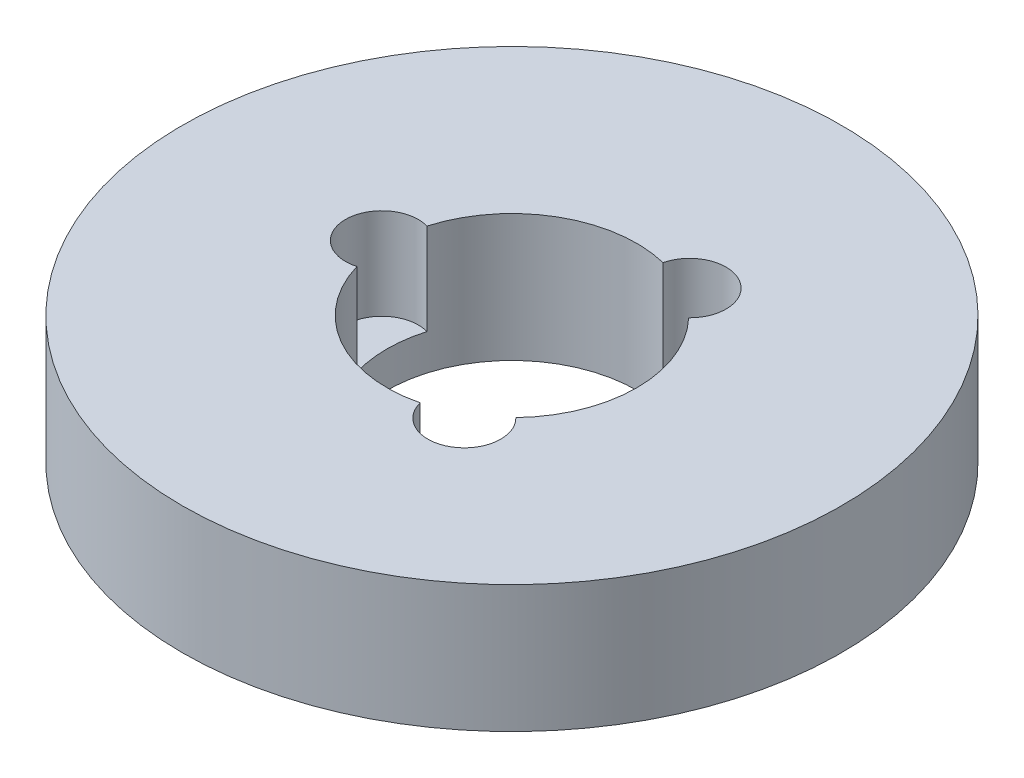
ISO-10303-21;
HEADER;
FILE_DESCRIPTION(('STEP AP214'),'2;1');
FILE_NAME('part.step','',(''),(''),'','','');
FILE_SCHEMA(('AUTOMOTIVE_DESIGN { 1 0 10303 214 1 1 1 1 }'));
ENDSEC;
DATA;
#1=APPLICATION_CONTEXT('core data for automotive mechanical design processes');
#2=APPLICATION_PROTOCOL_DEFINITION('international standard','automotive_design',2000,#1);
#3=PRODUCT_CONTEXT('',#1,'mechanical');
#4=PRODUCT('Part','Part','',(#3));
#5=PRODUCT_RELATED_PRODUCT_CATEGORY('part','',(#4));
#6=PRODUCT_DEFINITION_FORMATION('','',#4);
#7=PRODUCT_DEFINITION_CONTEXT('part definition',#1,'design');
#8=PRODUCT_DEFINITION('design','',#6,#7);
#9=PRODUCT_DEFINITION_SHAPE('','',#8);
#10=(LENGTH_UNIT() NAMED_UNIT(*) SI_UNIT(.MILLI.,.METRE.));
#11=(NAMED_UNIT(*) PLANE_ANGLE_UNIT() SI_UNIT($,.RADIAN.));
#12=(NAMED_UNIT(*) SI_UNIT($,.STERADIAN.) SOLID_ANGLE_UNIT());
#13=UNCERTAINTY_MEASURE_WITH_UNIT(LENGTH_MEASURE(1.E-05),#10,'distance_accuracy_value','');
#14=(GEOMETRIC_REPRESENTATION_CONTEXT(3) GLOBAL_UNCERTAINTY_ASSIGNED_CONTEXT((#13)) GLOBAL_UNIT_ASSIGNED_CONTEXT((#10,
#11,#12)) REPRESENTATION_CONTEXT('',''));
#15=CARTESIAN_POINT('',(0.,0.,0.));
#16=DIRECTION('',(0.,0.,1.));
#17=DIRECTION('',(1.,0.,0.));
#18=AXIS2_PLACEMENT_3D('',#15,#16,#17);
#19=CARTESIAN_POINT('',(0.,28.,0.));
#20=DIRECTION('',(0.,-1.,0.));
#21=DIRECTION('',(0.,0.,-1.));
#22=AXIS2_PLACEMENT_3D('',#19,#20,#21);
#23=CYLINDRICAL_SURFACE('',#22,72.5);
#24=CARTESIAN_POINT('',(0.,28.,0.));
#25=DIRECTION('',(0.,1.,0.));
#26=DIRECTION('',(0.,0.,1.));
#27=AXIS2_PLACEMENT_3D('',#24,#25,#26);
#28=CIRCLE('',#27,72.5);
#29=CARTESIAN_POINT('',(0.,28.,72.5));
#30=VERTEX_POINT('',#29);
#31=EDGE_CURVE('E126',#30,#30,#28,.T.);
#32=ORIENTED_EDGE('',*,*,#31,.F.);
#33=EDGE_LOOP('',(#32));
#34=FACE_BOUND('',#33,.T.);
#35=CARTESIAN_POINT('',(0.,0.,0.));
#36=DIRECTION('',(0.,1.,0.));
#37=DIRECTION('',(0.,0.,1.));
#38=AXIS2_PLACEMENT_3D('',#35,#36,#37);
#39=CIRCLE('',#38,72.5);
#40=CARTESIAN_POINT('',(0.,0.,72.5));
#41=VERTEX_POINT('',#40);
#42=EDGE_CURVE('E124',#41,#41,#39,.T.);
#43=ORIENTED_EDGE('',*,*,#42,.T.);
#44=EDGE_LOOP('',(#43));
#45=FACE_BOUND('',#44,.T.);
#46=ADVANCED_FACE('F39',(#34,#45),#23,.T.);
#47=CARTESIAN_POINT('',(0.,28.,0.));
#48=DIRECTION('',(0.,1.,0.));
#49=DIRECTION('',(0.,0.,1.));
#50=AXIS2_PLACEMENT_3D('',#47,#48,#49);
#51=PLANE('',#50);
#52=CARTESIAN_POINT('',(14.3055192135324,28.,24.7778861064906));
#53=DIRECTION('',(0.,1.,0.));
#54=DIRECTION('',(0.866025403784436,0.,-0.500000000000004));
#55=AXIS2_PLACEMENT_3D('',#52,#53,#54);
#56=CIRCLE('',#55,8.0153003426168);
#57=CARTESIAN_POINT('',(6.52758280328751,28.,26.714053656198));
#58=VERTEX_POINT('',#57);
#59=CARTESIAN_POINT('',(19.8712577026844,28.,19.0100793610522));
#60=VERTEX_POINT('',#59);
#61=EDGE_CURVE('E147',#58,#60,#56,.T.);
#62=ORIENTED_EDGE('',*,*,#61,.F.);
#63=CARTESIAN_POINT('',(0.,28.,0.));
#64=DIRECTION('',(0.,1.,0.));
#65=DIRECTION('',(0.,0.,1.));
#66=AXIS2_PLACEMENT_3D('',#63,#64,#65);
#67=CIRCLE('',#66,27.5);
#68=CARTESIAN_POINT('',(-26.3988405059717,28.,7.70397429514569));
#69=VERTEX_POINT('',#68);
#70=EDGE_CURVE('E118',#69,#58,#67,.T.);
#71=ORIENTED_EDGE('',*,*,#70,.F.);
#72=CARTESIAN_POINT('',(-28.6110384270646,28.,0.));
#73=DIRECTION('',(0.,1.,0.));
#74=DIRECTION('',(0.,0.,1.));
#75=AXIS2_PLACEMENT_3D('',#72,#73,#74);
#76=CIRCLE('',#75,8.0153003426168);
#77=CARTESIAN_POINT('',(-26.3988405059717,28.,-7.70397429514569));
#78=VERTEX_POINT('',#77);
#79=EDGE_CURVE('E113',#78,#69,#76,.T.);
#80=ORIENTED_EDGE('',*,*,#79,.F.);
#81=CARTESIAN_POINT('',(6.52758280328714,28.,-26.7140536561981));
#82=VERTEX_POINT('',#81);
#83=EDGE_CURVE('E106',#82,#78,#67,.T.);
#84=ORIENTED_EDGE('',*,*,#83,.F.);
#85=CARTESIAN_POINT('',(14.3055192135321,28.,-24.7778861064908));
#86=DIRECTION('',(0.,1.,0.));
#87=DIRECTION('',(-0.866025403784443,0.,-0.499999999999992));
#88=AXIS2_PLACEMENT_3D('',#85,#86,#87);
#89=CIRCLE('',#88,8.0153003426168);
#90=CARTESIAN_POINT('',(19.8712577026842,28.,-19.0100793610525));
#91=VERTEX_POINT('',#90);
#92=EDGE_CURVE('E90',#91,#82,#89,.T.);
#93=ORIENTED_EDGE('',*,*,#92,.F.);
#94=EDGE_CURVE('E116',#60,#91,#67,.T.);
#95=ORIENTED_EDGE('',*,*,#94,.F.);
#96=EDGE_LOOP('',(#62,#71,#80,#84,#93,#95));
#97=FACE_BOUND('',#96,.T.);
#98=ORIENTED_EDGE('',*,*,#31,.T.);
#99=EDGE_LOOP('',(#98));
#100=FACE_BOUND('',#99,.T.);
#101=ADVANCED_FACE('F115',(#97,#100),#51,.T.);
#102=CARTESIAN_POINT('',(0.,0.,0.));
#103=DIRECTION('',(0.,1.,0.));
#104=DIRECTION('',(0.,0.,1.));
#105=AXIS2_PLACEMENT_3D('',#102,#103,#104);
#106=PLANE('',#105);
#107=CARTESIAN_POINT('',(0.,0.,0.));
#108=DIRECTION('',(0.,1.,0.));
#109=DIRECTION('',(0.,0.,1.));
#110=AXIS2_PLACEMENT_3D('',#107,#108,#109);
#111=CIRCLE('',#110,27.5);
#112=CARTESIAN_POINT('',(0.,0.,27.5));
#113=VERTEX_POINT('',#112);
#114=EDGE_CURVE('E120',#113,#113,#111,.T.);
#115=ORIENTED_EDGE('',*,*,#114,.T.);
#116=EDGE_LOOP('',(#115));
#117=FACE_BOUND('',#116,.T.);
#118=ORIENTED_EDGE('',*,*,#42,.F.);
#119=EDGE_LOOP('',(#118));
#120=FACE_BOUND('',#119,.T.);
#121=ADVANCED_FACE('F164',(#117,#120),#106,.F.);
#122=CARTESIAN_POINT('',(0.,28.,0.));
#123=DIRECTION('',(0.,-1.,0.));
#124=DIRECTION('',(0.,0.,-1.));
#125=AXIS2_PLACEMENT_3D('',#122,#123,#124);
#126=CYLINDRICAL_SURFACE('',#125,27.5);
#127=DIRECTION('',(0.,1.,0.));
#128=VECTOR('',#127,1.);
#129=CARTESIAN_POINT('',(6.52758280328751,17.9477470885651,26.714053656198));
#130=LINE('',#129,#128);
#131=CARTESIAN_POINT('',(6.52758280328751,7.89549417713014,26.714053656198));
#132=VERTEX_POINT('',#131);
#133=EDGE_CURVE('E11',#132,#58,#130,.T.);
#134=ORIENTED_EDGE('',*,*,#133,.F.);
#135=CARTESIAN_POINT('',(0.,7.89549417713014,0.));
#136=DIRECTION('',(0.,1.,0.));
#137=DIRECTION('',(0.,0.,1.));
#138=AXIS2_PLACEMENT_3D('',#135,#136,#137);
#139=CIRCLE('',#138,27.5);
#140=CARTESIAN_POINT('',(19.8712577026844,7.89549417713014,19.0100793610522));
#141=VERTEX_POINT('',#140);
#142=EDGE_CURVE('E144',#132,#141,#139,.T.);
#143=ORIENTED_EDGE('',*,*,#142,.T.);
#144=DIRECTION('',(0.,1.,0.));
#145=VECTOR('',#144,1.);
#146=CARTESIAN_POINT('',(19.8712577026844,17.9477470885651,19.0100793610522));
#147=LINE('',#146,#145);
#148=EDGE_CURVE('E46',#60,#141,#147,.F.);
#149=ORIENTED_EDGE('',*,*,#148,.F.);
#150=ORIENTED_EDGE('',*,*,#94,.T.);
#151=DIRECTION('',(0.,1.,0.));
#152=VECTOR('',#151,1.);
#153=CARTESIAN_POINT('',(19.8712577026842,17.9477470885651,-19.0100793610525));
#154=LINE('',#153,#152);
#155=CARTESIAN_POINT('',(19.8712577026842,7.89549417713014,-19.0100793610525));
#156=VERTEX_POINT('',#155);
#157=EDGE_CURVE('E92',#156,#91,#154,.T.);
#158=ORIENTED_EDGE('',*,*,#157,.F.);
#159=CARTESIAN_POINT('',(0.,7.89549417713014,0.));
#160=DIRECTION('',(0.,1.,0.));
#161=DIRECTION('',(0.,0.,1.));
#162=AXIS2_PLACEMENT_3D('',#159,#160,#161);
#163=CIRCLE('',#162,27.5);
#164=CARTESIAN_POINT('',(6.52758280328714,7.89549417713014,-26.7140536561981));
#165=VERTEX_POINT('',#164);
#166=EDGE_CURVE('E107',#156,#165,#163,.T.);
#167=ORIENTED_EDGE('',*,*,#166,.T.);
#168=DIRECTION('',(0.,1.,0.));
#169=VECTOR('',#168,1.);
#170=CARTESIAN_POINT('',(6.52758280328714,17.9477470885651,-26.7140536561981));
#171=LINE('',#170,#169);
#172=EDGE_CURVE('E95',#82,#165,#171,.F.);
#173=ORIENTED_EDGE('',*,*,#172,.F.);
#174=ORIENTED_EDGE('',*,*,#83,.T.);
#175=DIRECTION('',(0.,1.,0.));
#176=VECTOR('',#175,1.);
#177=CARTESIAN_POINT('',(-26.3988405059717,17.9477470885651,-7.70397429514569));
#178=LINE('',#177,#176);
#179=CARTESIAN_POINT('',(-26.3988405059717,7.89549417713014,-7.70397429514569));
#180=VERTEX_POINT('',#179);
#181=EDGE_CURVE('E143',#180,#78,#178,.T.);
#182=ORIENTED_EDGE('',*,*,#181,.F.);
#183=CARTESIAN_POINT('',(0.,7.89549417713014,0.));
#184=DIRECTION('',(0.,1.,0.));
#185=DIRECTION('',(0.,0.,1.));
#186=AXIS2_PLACEMENT_3D('',#183,#184,#185);
#187=CIRCLE('',#186,27.5);
#188=CARTESIAN_POINT('',(-26.3988405059717,7.89549417713014,7.70397429514569));
#189=VERTEX_POINT('',#188);
#190=EDGE_CURVE('E132',#180,#189,#187,.T.);
#191=ORIENTED_EDGE('',*,*,#190,.T.);
#192=DIRECTION('',(0.,1.,0.));
#193=VECTOR('',#192,1.);
#194=CARTESIAN_POINT('',(-26.3988405059717,17.9477470885651,7.70397429514569));
#195=LINE('',#194,#193);
#196=EDGE_CURVE('E137',#69,#189,#195,.F.);
#197=ORIENTED_EDGE('',*,*,#196,.F.);
#198=ORIENTED_EDGE('',*,*,#70,.T.);
#199=EDGE_LOOP('',(#134,#143,#149,#150,#158,#167,#173,#174,#182,#191,#197,#198));
#200=FACE_BOUND('',#199,.T.);
#201=ORIENTED_EDGE('',*,*,#114,.F.);
#202=EDGE_LOOP('',(#201));
#203=FACE_BOUND('',#202,.T.);
#204=ADVANCED_FACE('F103',(#200,#203),#126,.F.);
#205=CARTESIAN_POINT('',(-28.6110384270646,7.89549417713014,0.));
#206=DIRECTION('',(0.,1.,0.));
#207=DIRECTION('',(0.,0.,1.));
#208=AXIS2_PLACEMENT_3D('',#205,#206,#207);
#209=CYLINDRICAL_SURFACE('',#208,8.0153003426168);
#210=ORIENTED_EDGE('',*,*,#181,.T.);
#211=ORIENTED_EDGE('',*,*,#79,.T.);
#212=ORIENTED_EDGE('',*,*,#196,.T.);
#213=CARTESIAN_POINT('',(-28.6110384270646,7.89549417713014,0.));
#214=DIRECTION('',(0.,1.,0.));
#215=DIRECTION('',(0.,0.,1.));
#216=AXIS2_PLACEMENT_3D('',#213,#214,#215);
#217=CIRCLE('',#216,8.0153003426168);
#218=EDGE_CURVE('E121',#180,#189,#217,.T.);
#219=ORIENTED_EDGE('',*,*,#218,.F.);
#220=EDGE_LOOP('',(#210,#211,#212,#219));
#221=FACE_BOUND('',#220,.T.);
#222=ADVANCED_FACE('F174',(#221),#209,.F.);
#223=CARTESIAN_POINT('',(-28.6110384270646,7.89549417713014,0.));
#224=DIRECTION('',(0.,1.,0.));
#225=DIRECTION('',(0.,0.,1.));
#226=AXIS2_PLACEMENT_3D('',#223,#224,#225);
#227=PLANE('',#226);
#228=ORIENTED_EDGE('',*,*,#218,.T.);
#229=ORIENTED_EDGE('',*,*,#190,.F.);
#230=EDGE_LOOP('',(#228,#229));
#231=FACE_BOUND('',#230,.T.);
#232=ADVANCED_FACE('F177',(#231),#227,.T.);
#233=CARTESIAN_POINT('',(14.3055192135321,7.89549417713014,-24.7778861064908));
#234=DIRECTION('',(0.,1.,0.));
#235=DIRECTION('',(0.,0.,1.));
#236=AXIS2_PLACEMENT_3D('',#233,#234,#235);
#237=CYLINDRICAL_SURFACE('',#236,8.0153003426168);
#238=ORIENTED_EDGE('',*,*,#157,.T.);
#239=ORIENTED_EDGE('',*,*,#92,.T.);
#240=ORIENTED_EDGE('',*,*,#172,.T.);
#241=CARTESIAN_POINT('',(14.3055192135321,7.89549417713014,-24.7778861064908));
#242=DIRECTION('',(0.,1.,0.));
#243=DIRECTION('',(-0.866025403784443,0.,-0.499999999999992));
#244=AXIS2_PLACEMENT_3D('',#241,#242,#243);
#245=CIRCLE('',#244,8.0153003426168);
#246=EDGE_CURVE('E56',#156,#165,#245,.T.);
#247=ORIENTED_EDGE('',*,*,#246,.F.);
#248=EDGE_LOOP('',(#238,#239,#240,#247));
#249=FACE_BOUND('',#248,.T.);
#250=ADVANCED_FACE('F93',(#249),#237,.F.);
#251=CARTESIAN_POINT('',(14.3055192135321,7.89549417713014,-24.7778861064908));
#252=DIRECTION('',(0.,1.,0.));
#253=DIRECTION('',(-0.866025403784443,0.,-0.499999999999992));
#254=AXIS2_PLACEMENT_3D('',#251,#252,#253);
#255=PLANE('',#254);
#256=ORIENTED_EDGE('',*,*,#246,.T.);
#257=ORIENTED_EDGE('',*,*,#166,.F.);
#258=EDGE_LOOP('',(#256,#257));
#259=FACE_BOUND('',#258,.T.);
#260=ADVANCED_FACE('F160',(#259),#255,.T.);
#261=CARTESIAN_POINT('',(14.3055192135324,7.89549417713014,24.7778861064906));
#262=DIRECTION('',(0.,1.,0.));
#263=DIRECTION('',(0.,0.,1.));
#264=AXIS2_PLACEMENT_3D('',#261,#262,#263);
#265=CYLINDRICAL_SURFACE('',#264,8.0153003426168);
#266=ORIENTED_EDGE('',*,*,#133,.T.);
#267=ORIENTED_EDGE('',*,*,#61,.T.);
#268=ORIENTED_EDGE('',*,*,#148,.T.);
#269=CARTESIAN_POINT('',(14.3055192135324,7.89549417713014,24.7778861064906));
#270=DIRECTION('',(0.,1.,0.));
#271=DIRECTION('',(0.866025403784436,0.,-0.500000000000004));
#272=AXIS2_PLACEMENT_3D('',#269,#270,#271);
#273=CIRCLE('',#272,8.0153003426168);
#274=EDGE_CURVE('E55',#132,#141,#273,.T.);
#275=ORIENTED_EDGE('',*,*,#274,.F.);
#276=EDGE_LOOP('',(#266,#267,#268,#275));
#277=FACE_BOUND('',#276,.T.);
#278=ADVANCED_FACE('F149',(#277),#265,.F.);
#279=CARTESIAN_POINT('',(14.3055192135324,7.89549417713014,24.7778861064906));
#280=DIRECTION('',(0.,1.,0.));
#281=DIRECTION('',(0.866025403784436,0.,-0.500000000000004));
#282=AXIS2_PLACEMENT_3D('',#279,#280,#281);
#283=PLANE('',#282);
#284=ORIENTED_EDGE('',*,*,#274,.T.);
#285=ORIENTED_EDGE('',*,*,#142,.F.);
#286=EDGE_LOOP('',(#284,#285));
#287=FACE_BOUND('',#286,.T.);
#288=ADVANCED_FACE('F151',(#287),#283,.T.);
#289=CLOSED_SHELL('',(#46,#101,#121,#204,#222,#232,#250,#260,#278,#288));
#290=MANIFOLD_SOLID_BREP('B2',#289);
#291=ADVANCED_BREP_SHAPE_REPRESENTATION('',(#18,#290),#14);
#292=SHAPE_DEFINITION_REPRESENTATION(#9,#291);
ENDSEC;
END-ISO-10303-21;
